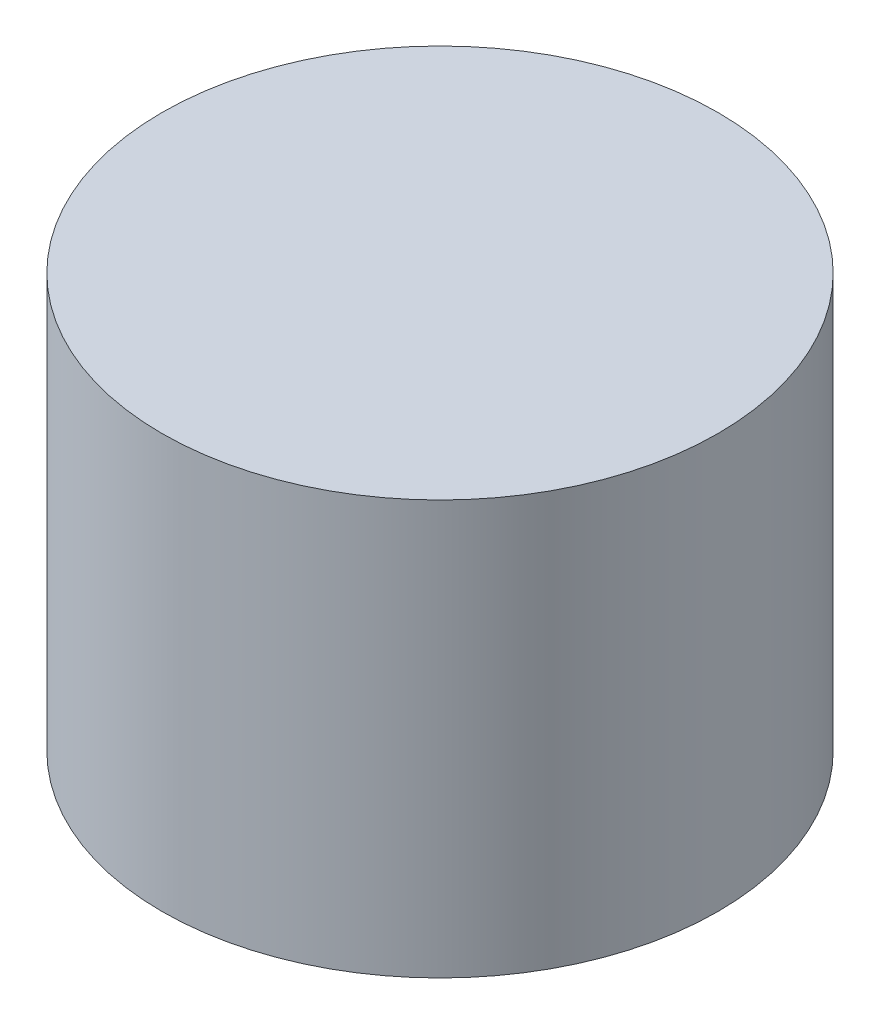
ISO-10303-21;
HEADER;
FILE_DESCRIPTION(('STEP AP214'),'2;1');
FILE_NAME('part.step','',(''),(''),'','','');
FILE_SCHEMA(('AUTOMOTIVE_DESIGN { 1 0 10303 214 1 1 1 1 }'));
ENDSEC;
DATA;
#1=APPLICATION_CONTEXT('core data for automotive mechanical design processes');
#2=APPLICATION_PROTOCOL_DEFINITION('international standard','automotive_design',2000,#1);
#3=PRODUCT_CONTEXT('',#1,'mechanical');
#4=PRODUCT('Part','Part','',(#3));
#5=PRODUCT_RELATED_PRODUCT_CATEGORY('part','',(#4));
#6=PRODUCT_DEFINITION_FORMATION('','',#4);
#7=PRODUCT_DEFINITION_CONTEXT('part definition',#1,'design');
#8=PRODUCT_DEFINITION('design','',#6,#7);
#9=PRODUCT_DEFINITION_SHAPE('','',#8);
#10=(LENGTH_UNIT() NAMED_UNIT(*) SI_UNIT(.MILLI.,.METRE.));
#11=(NAMED_UNIT(*) PLANE_ANGLE_UNIT() SI_UNIT($,.RADIAN.));
#12=(NAMED_UNIT(*) SI_UNIT($,.STERADIAN.) SOLID_ANGLE_UNIT());
#13=UNCERTAINTY_MEASURE_WITH_UNIT(LENGTH_MEASURE(1.E-05),#10,'distance_accuracy_value','');
#14=(GEOMETRIC_REPRESENTATION_CONTEXT(3) GLOBAL_UNCERTAINTY_ASSIGNED_CONTEXT((#13)) GLOBAL_UNIT_ASSIGNED_CONTEXT((#10,
#11,#12)) REPRESENTATION_CONTEXT('',''));
#15=CARTESIAN_POINT('',(0.,0.,0.));
#16=DIRECTION('',(0.,0.,1.));
#17=DIRECTION('',(1.,0.,0.));
#18=AXIS2_PLACEMENT_3D('',#15,#16,#17);
#19=CARTESIAN_POINT('',(0.,0.,0.));
#20=DIRECTION('',(0.,1.,0.));
#21=DIRECTION('',(0.,0.,1.));
#22=AXIS2_PLACEMENT_3D('',#19,#20,#21);
#23=PLANE('',#22);
#24=CARTESIAN_POINT('',(0.,0.,0.));
#25=DIRECTION('',(0.,1.,0.));
#26=DIRECTION('',(0.,0.,1.));
#27=AXIS2_PLACEMENT_3D('',#24,#25,#26);
#28=CIRCLE('',#27,45.);
#29=CARTESIAN_POINT('',(0.,0.,45.));
#30=VERTEX_POINT('',#29);
#31=EDGE_CURVE('E10',#30,#30,#28,.T.);
#32=ORIENTED_EDGE('',*,*,#31,.F.);
#33=EDGE_LOOP('',(#32));
#34=FACE_BOUND('',#33,.T.);
#35=CARTESIAN_POINT('',(0.,0.,0.));
#36=DIRECTION('',(0.,1.,0.));
#37=DIRECTION('',(0.,0.,1.));
#38=AXIS2_PLACEMENT_3D('',#35,#36,#37);
#39=CIRCLE('',#38,42.8);
#40=CARTESIAN_POINT('',(0.,0.,42.8));
#41=VERTEX_POINT('',#40);
#42=EDGE_CURVE('E40',#41,#41,#39,.T.);
#43=ORIENTED_EDGE('',*,*,#42,.T.);
#44=EDGE_LOOP('',(#43));
#45=FACE_BOUND('',#44,.T.);
#46=ADVANCED_FACE('F33',(#34,#45),#23,.F.);
#47=CARTESIAN_POINT('',(0.,65.,0.));
#48=DIRECTION('',(0.,-1.,0.));
#49=DIRECTION('',(0.,0.,-1.));
#50=AXIS2_PLACEMENT_3D('',#47,#48,#49);
#51=CYLINDRICAL_SURFACE('',#50,45.);
#52=ORIENTED_EDGE('',*,*,#31,.T.);
#53=EDGE_LOOP('',(#52));
#54=FACE_BOUND('',#53,.T.);
#55=CARTESIAN_POINT('',(0.,67.,0.));
#56=DIRECTION('',(0.,1.,0.));
#57=DIRECTION('',(0.,0.,1.));
#58=AXIS2_PLACEMENT_3D('',#55,#56,#57);
#59=CIRCLE('',#58,45.);
#60=CARTESIAN_POINT('',(0.,67.,45.));
#61=VERTEX_POINT('',#60);
#62=EDGE_CURVE('E48',#61,#61,#59,.T.);
#63=ORIENTED_EDGE('',*,*,#62,.F.);
#64=EDGE_LOOP('',(#63));
#65=FACE_BOUND('',#64,.T.);
#66=ADVANCED_FACE('F35',(#54,#65),#51,.T.);
#67=CARTESIAN_POINT('',(0.,65.,0.));
#68=DIRECTION('',(0.,-1.,0.));
#69=DIRECTION('',(0.,0.,-1.));
#70=AXIS2_PLACEMENT_3D('',#67,#68,#69);
#71=CYLINDRICAL_SURFACE('',#70,42.8);
#72=CARTESIAN_POINT('',(0.,65.,0.));
#73=DIRECTION('',(0.,1.,0.));
#74=DIRECTION('',(0.,0.,1.));
#75=AXIS2_PLACEMENT_3D('',#72,#73,#74);
#76=CIRCLE('',#75,42.8);
#77=CARTESIAN_POINT('',(0.,65.,42.8));
#78=VERTEX_POINT('',#77);
#79=EDGE_CURVE('E44',#78,#78,#76,.T.);
#80=ORIENTED_EDGE('',*,*,#79,.T.);
#81=EDGE_LOOP('',(#80));
#82=FACE_BOUND('',#81,.T.);
#83=ORIENTED_EDGE('',*,*,#42,.F.);
#84=EDGE_LOOP('',(#83));
#85=FACE_BOUND('',#84,.T.);
#86=ADVANCED_FACE('F57',(#82,#85),#71,.F.);
#87=CARTESIAN_POINT('',(0.,65.,0.));
#88=DIRECTION('',(0.,1.,0.));
#89=DIRECTION('',(0.,0.,1.));
#90=AXIS2_PLACEMENT_3D('',#87,#88,#89);
#91=PLANE('',#90);
#92=ORIENTED_EDGE('',*,*,#79,.F.);
#93=EDGE_LOOP('',(#92));
#94=FACE_BOUND('',#93,.T.);
#95=ADVANCED_FACE('F62',(#94),#91,.F.);
#96=CARTESIAN_POINT('',(0.,67.,0.));
#97=DIRECTION('',(0.,1.,0.));
#98=DIRECTION('',(0.,0.,1.));
#99=AXIS2_PLACEMENT_3D('',#96,#97,#98);
#100=PLANE('',#99);
#101=ORIENTED_EDGE('',*,*,#62,.T.);
#102=EDGE_LOOP('',(#101));
#103=FACE_BOUND('',#102,.T.);
#104=ADVANCED_FACE('F54',(#103),#100,.T.);
#105=CLOSED_SHELL('',(#46,#66,#86,#95,#104));
#106=MANIFOLD_SOLID_BREP('B2',#105);
#107=ADVANCED_BREP_SHAPE_REPRESENTATION('',(#18,#106),#14);
#108=SHAPE_DEFINITION_REPRESENTATION(#9,#107);
ENDSEC;
END-ISO-10303-21;
